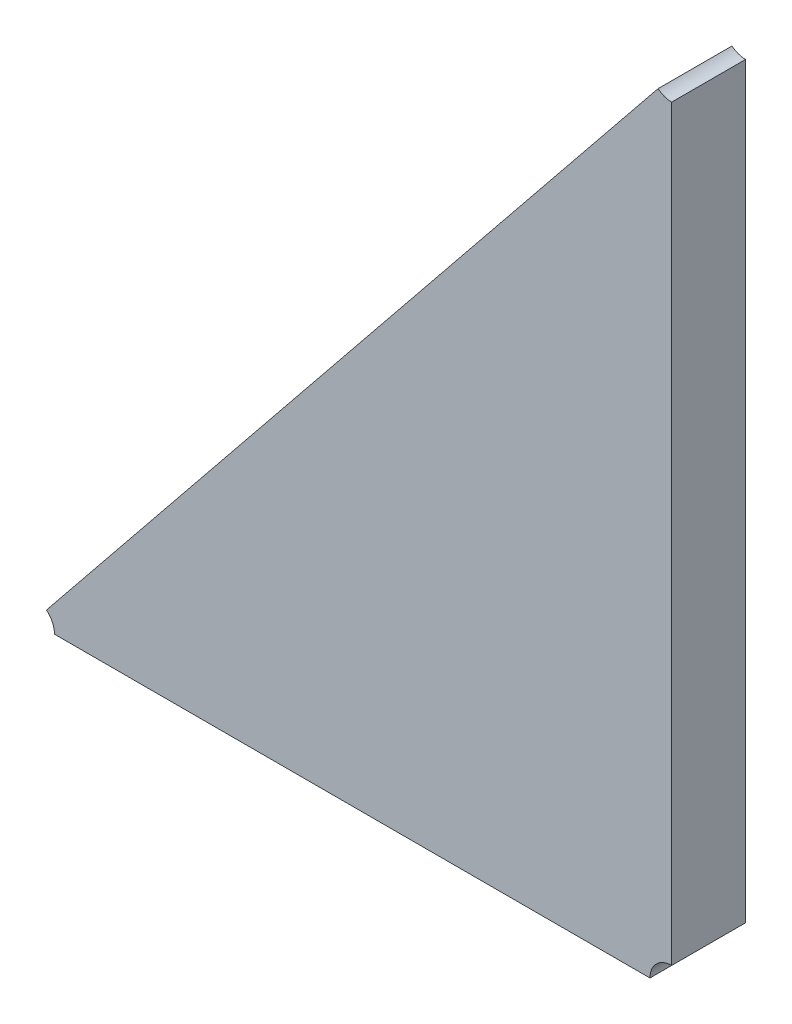
ISO-10303-21;
HEADER;
FILE_DESCRIPTION(('STEP AP214'),'2;1');
FILE_NAME('part.step','',(''),(''),'','','');
FILE_SCHEMA(('AUTOMOTIVE_DESIGN { 1 0 10303 214 1 1 1 1 }'));
ENDSEC;
DATA;
#1=APPLICATION_CONTEXT('core data for automotive mechanical design processes');
#2=APPLICATION_PROTOCOL_DEFINITION('international standard','automotive_design',2000,#1);
#3=PRODUCT_CONTEXT('',#1,'mechanical');
#4=PRODUCT('Part','Part','',(#3));
#5=PRODUCT_RELATED_PRODUCT_CATEGORY('part','',(#4));
#6=PRODUCT_DEFINITION_FORMATION('','',#4);
#7=PRODUCT_DEFINITION_CONTEXT('part definition',#1,'design');
#8=PRODUCT_DEFINITION('design','',#6,#7);
#9=PRODUCT_DEFINITION_SHAPE('','',#8);
#10=(LENGTH_UNIT() NAMED_UNIT(*) SI_UNIT(.MILLI.,.METRE.));
#11=(NAMED_UNIT(*) PLANE_ANGLE_UNIT() SI_UNIT($,.RADIAN.));
#12=(NAMED_UNIT(*) SI_UNIT($,.STERADIAN.) SOLID_ANGLE_UNIT());
#13=UNCERTAINTY_MEASURE_WITH_UNIT(LENGTH_MEASURE(1.E-05),#10,'distance_accuracy_value','');
#14=(GEOMETRIC_REPRESENTATION_CONTEXT(3) GLOBAL_UNCERTAINTY_ASSIGNED_CONTEXT((#13)) GLOBAL_UNIT_ASSIGNED_CONTEXT((#10,
#11,#12)) REPRESENTATION_CONTEXT('',''));
#15=CARTESIAN_POINT('',(0.,0.,0.));
#16=DIRECTION('',(0.,0.,1.));
#17=DIRECTION('',(1.,0.,0.));
#18=AXIS2_PLACEMENT_3D('',#15,#16,#17);
#19=CARTESIAN_POINT('',(-1.73054821123528,-1.35463051118407,0.0042));
#20=DIRECTION('',(0.,0.,1.));
#21=DIRECTION('',(1.,0.,0.));
#22=AXIS2_PLACEMENT_3D('',#19,#20,#21);
#23=PLANE('',#22);
#24=CARTESIAN_POINT('',(-1.76950550169011,-1.38144679395879,0.0042));
#25=DIRECTION('',(0.,0.,-1.));
#26=DIRECTION('',(0.628289208449183,0.777979865129104,0.));
#27=AXIS2_PLACEMENT_3D('',#24,#25,#26);
#28=CIRCLE('',#27,0.00199999999999998);
#29=CARTESIAN_POINT('',(-1.76824892327321,-1.37989083422853,0.0042));
#30=VERTEX_POINT('',#29);
#31=CARTESIAN_POINT('',(-1.76750550169011,-1.38144679395879,0.0042));
#32=VERTEX_POINT('',#31);
#33=EDGE_CURVE('E11',#30,#32,#28,.T.);
#34=ORIENTED_EDGE('',*,*,#33,.T.);
#35=DIRECTION('',(1.,0.,0.));
#36=VECTOR('',#35,1.);
#37=CARTESIAN_POINT('',(-1.76750550169011,-1.38144679395879,0.0042));
#38=LINE('',#37,#36);
#39=CARTESIAN_POINT('',(-1.71269826462096,-1.38144679395879,0.0042));
#40=VERTEX_POINT('',#39);
#41=EDGE_CURVE('E102',#32,#40,#38,.T.);
#42=ORIENTED_EDGE('',*,*,#41,.T.);
#43=CARTESIAN_POINT('',(-1.71069826462096,-1.38144679395879,0.0042));
#44=DIRECTION('',(0.,0.,-1.));
#45=DIRECTION('',(-1.,0.,0.));
#46=AXIS2_PLACEMENT_3D('',#43,#44,#45);
#47=CIRCLE('',#46,0.002);
#48=CARTESIAN_POINT('',(-1.71069826462096,-1.37944679395879,0.0042));
#49=VERTEX_POINT('',#48);
#50=EDGE_CURVE('E89',#40,#49,#47,.T.);
#51=ORIENTED_EDGE('',*,*,#50,.T.);
#52=DIRECTION('',(0.,1.,0.));
#53=VECTOR('',#52,1.);
#54=CARTESIAN_POINT('',(-1.71069826462096,-1.37944679395879,0.0042));
#55=LINE('',#54,#53);
#56=CARTESIAN_POINT('',(-1.71069826462096,-1.31062866219989,0.0042));
#57=VERTEX_POINT('',#56);
#58=EDGE_CURVE('E94',#49,#57,#55,.T.);
#59=ORIENTED_EDGE('',*,*,#58,.T.);
#60=CARTESIAN_POINT('',(-1.71069826462096,-1.30862866219989,0.0042));
#61=DIRECTION('',(0.,0.,-1.));
#62=DIRECTION('',(0.,-1.,0.));
#63=AXIS2_PLACEMENT_3D('',#60,#61,#62);
#64=CIRCLE('',#63,0.00199999999999999);
#65=CARTESIAN_POINT('',(-1.71195484303787,-1.31018462193015,0.0042));
#66=VERTEX_POINT('',#65);
#67=EDGE_CURVE('E116',#57,#66,#64,.T.);
#68=ORIENTED_EDGE('',*,*,#67,.T.);
#69=DIRECTION('',(-0.628289208450209,-0.777979865128276,0.));
#70=VECTOR('',#69,1.);
#71=CARTESIAN_POINT('',(-1.71195484303787,-1.31018462193015,0.0042));
#72=LINE('',#71,#70);
#73=EDGE_CURVE('E75',#66,#30,#72,.T.);
#74=ORIENTED_EDGE('',*,*,#73,.T.);
#75=EDGE_LOOP('',(#34,#42,#51,#59,#68,#74));
#76=FACE_BOUND('',#75,.T.);
#77=ADVANCED_FACE('F17',(#76),#23,.T.);
#78=CARTESIAN_POINT('',(-1.76950550169011,-1.38144679395879,-0.0018));
#79=DIRECTION('',(0.,0.,1.));
#80=DIRECTION('',(-1.,0.,0.));
#81=AXIS2_PLACEMENT_3D('',#78,#79,#80);
#82=CYLINDRICAL_SURFACE('',#81,0.00199999999999998);
#83=DIRECTION('',(0.,0.,1.));
#84=VECTOR('',#83,1.);
#85=CARTESIAN_POINT('',(-1.76824892327321,-1.37989083422853,-0.0026));
#86=LINE('',#85,#84);
#87=CARTESIAN_POINT('',(-1.76824892327321,-1.37989083422853,-0.0026));
#88=VERTEX_POINT('',#87);
#89=EDGE_CURVE('E24',#88,#30,#86,.T.);
#90=ORIENTED_EDGE('',*,*,#89,.F.);
#91=CARTESIAN_POINT('',(-1.76950550169011,-1.38144679395879,-0.0026));
#92=DIRECTION('',(0.,0.,1.));
#93=DIRECTION('',(1.,0.,0.));
#94=AXIS2_PLACEMENT_3D('',#91,#92,#93);
#95=CIRCLE('',#94,0.00199999999999998);
#96=CARTESIAN_POINT('',(-1.76750550169011,-1.38144679395879,-0.0026));
#97=VERTEX_POINT('',#96);
#98=EDGE_CURVE('E72',#97,#88,#95,.T.);
#99=ORIENTED_EDGE('',*,*,#98,.F.);
#100=DIRECTION('',(0.,0.,1.));
#101=VECTOR('',#100,1.);
#102=CARTESIAN_POINT('',(-1.76750550169011,-1.38144679395879,-0.0026));
#103=LINE('',#102,#101);
#104=EDGE_CURVE('E90',#97,#32,#103,.T.);
#105=ORIENTED_EDGE('',*,*,#104,.T.);
#106=ORIENTED_EDGE('',*,*,#33,.F.);
#107=EDGE_LOOP('',(#90,#99,#105,#106));
#108=FACE_BOUND('',#107,.T.);
#109=ADVANCED_FACE('F138',(#108),#82,.F.);
#110=CARTESIAN_POINT('',(-1.71069826462096,-1.38144679395879,-0.0018));
#111=DIRECTION('',(0.,0.,1.));
#112=DIRECTION('',(-1.,0.,0.));
#113=AXIS2_PLACEMENT_3D('',#110,#111,#112);
#114=CYLINDRICAL_SURFACE('',#113,0.002);
#115=DIRECTION('',(0.,0.,-1.));
#116=VECTOR('',#115,1.);
#117=CARTESIAN_POINT('',(-1.71069826462096,-1.37944679395879,0.0042));
#118=LINE('',#117,#116);
#119=CARTESIAN_POINT('',(-1.71069826462096,-1.37944679395879,-0.0026));
#120=VERTEX_POINT('',#119);
#121=EDGE_CURVE('E99',#49,#120,#118,.T.);
#122=ORIENTED_EDGE('',*,*,#121,.F.);
#123=ORIENTED_EDGE('',*,*,#50,.F.);
#124=DIRECTION('',(0.,0.,1.));
#125=VECTOR('',#124,1.);
#126=CARTESIAN_POINT('',(-1.71269826462096,-1.38144679395879,-0.0026));
#127=LINE('',#126,#125);
#128=CARTESIAN_POINT('',(-1.71269826462096,-1.38144679395879,-0.0026));
#129=VERTEX_POINT('',#128);
#130=EDGE_CURVE('E111',#129,#40,#127,.T.);
#131=ORIENTED_EDGE('',*,*,#130,.F.);
#132=CARTESIAN_POINT('',(-1.71069826462096,-1.38144679395879,-0.0026));
#133=DIRECTION('',(0.,0.,1.));
#134=DIRECTION('',(0.,1.,0.));
#135=AXIS2_PLACEMENT_3D('',#132,#133,#134);
#136=CIRCLE('',#135,0.002);
#137=EDGE_CURVE('E123',#120,#129,#136,.T.);
#138=ORIENTED_EDGE('',*,*,#137,.F.);
#139=EDGE_LOOP('',(#122,#123,#131,#138));
#140=FACE_BOUND('',#139,.T.);
#141=ADVANCED_FACE('F110',(#140),#114,.F.);
#142=CARTESIAN_POINT('',(-1.71069826462096,-1.30862866219989,-0.0018));
#143=DIRECTION('',(0.,0.,1.));
#144=DIRECTION('',(-1.,0.,0.));
#145=AXIS2_PLACEMENT_3D('',#142,#143,#144);
#146=CYLINDRICAL_SURFACE('',#145,0.00199999999999999);
#147=DIRECTION('',(0.,0.,-1.));
#148=VECTOR('',#147,1.);
#149=CARTESIAN_POINT('',(-1.71195484303787,-1.31018462193015,0.0042));
#150=LINE('',#149,#148);
#151=CARTESIAN_POINT('',(-1.71195484303787,-1.31018462193015,-0.0026));
#152=VERTEX_POINT('',#151);
#153=EDGE_CURVE('E80',#66,#152,#150,.T.);
#154=ORIENTED_EDGE('',*,*,#153,.F.);
#155=ORIENTED_EDGE('',*,*,#67,.F.);
#156=DIRECTION('',(0.,0.,1.));
#157=VECTOR('',#156,1.);
#158=CARTESIAN_POINT('',(-1.71069826462096,-1.31062866219989,-0.0026));
#159=LINE('',#158,#157);
#160=CARTESIAN_POINT('',(-1.71069826462096,-1.31062866219989,-0.0026));
#161=VERTEX_POINT('',#160);
#162=EDGE_CURVE('E83',#161,#57,#159,.T.);
#163=ORIENTED_EDGE('',*,*,#162,.F.);
#164=CARTESIAN_POINT('',(-1.71069826462096,-1.30862866219989,-0.0026));
#165=DIRECTION('',(0.,0.,1.));
#166=DIRECTION('',(-0.628289208452259,-0.77797986512662,0.));
#167=AXIS2_PLACEMENT_3D('',#164,#165,#166);
#168=CIRCLE('',#167,0.00199999999999999);
#169=EDGE_CURVE('E70',#152,#161,#168,.T.);
#170=ORIENTED_EDGE('',*,*,#169,.F.);
#171=EDGE_LOOP('',(#154,#155,#163,#170));
#172=FACE_BOUND('',#171,.T.);
#173=ADVANCED_FACE('F78',(#172),#146,.F.);
#174=CARTESIAN_POINT('',(-1.71069826462096,-1.38144679395879,-0.0026));
#175=DIRECTION('',(0.,1.,0.));
#176=DIRECTION('',(-1.,0.,0.));
#177=AXIS2_PLACEMENT_3D('',#174,#175,#176);
#178=PLANE('',#177);
#179=ORIENTED_EDGE('',*,*,#104,.F.);
#180=DIRECTION('',(-1.,0.,0.));
#181=VECTOR('',#180,1.);
#182=CARTESIAN_POINT('',(-1.71269826462096,-1.38144679395879,-0.0026));
#183=LINE('',#182,#181);
#184=EDGE_CURVE('E114',#129,#97,#183,.T.);
#185=ORIENTED_EDGE('',*,*,#184,.F.);
#186=ORIENTED_EDGE('',*,*,#130,.T.);
#187=ORIENTED_EDGE('',*,*,#41,.F.);
#188=EDGE_LOOP('',(#179,#185,#186,#187));
#189=FACE_BOUND('',#188,.T.);
#190=ADVANCED_FACE('F113',(#189),#178,.F.);
#191=CARTESIAN_POINT('',(-1.73059528913703,-1.35454432209785,-0.0026));
#192=DIRECTION('',(0.,0.,-1.));
#193=DIRECTION('',(-1.,0.,0.));
#194=AXIS2_PLACEMENT_3D('',#191,#192,#193);
#195=PLANE('',#194);
#196=ORIENTED_EDGE('',*,*,#98,.T.);
#197=DIRECTION('',(0.628289208450207,0.777979865128277,0.));
#198=VECTOR('',#197,1.);
#199=CARTESIAN_POINT('',(-1.76824892327321,-1.37989083422853,-0.0026));
#200=LINE('',#199,#198);
#201=EDGE_CURVE('E66',#88,#152,#200,.T.);
#202=ORIENTED_EDGE('',*,*,#201,.T.);
#203=ORIENTED_EDGE('',*,*,#169,.T.);
#204=DIRECTION('',(0.,-1.,0.));
#205=VECTOR('',#204,1.);
#206=CARTESIAN_POINT('',(-1.71069826462096,-1.31062866219989,-0.0026));
#207=LINE('',#206,#205);
#208=EDGE_CURVE('E85',#161,#120,#207,.T.);
#209=ORIENTED_EDGE('',*,*,#208,.T.);
#210=ORIENTED_EDGE('',*,*,#137,.T.);
#211=ORIENTED_EDGE('',*,*,#184,.T.);
#212=EDGE_LOOP('',(#196,#202,#203,#209,#210,#211));
#213=FACE_BOUND('',#212,.T.);
#214=ADVANCED_FACE('F68',(#213),#195,.T.);
#215=CARTESIAN_POINT('',(-1.71069826462096,-1.30862866219989,-0.0026));
#216=DIRECTION('',(-1.,0.,0.));
#217=DIRECTION('',(0.,-1.,0.));
#218=AXIS2_PLACEMENT_3D('',#215,#216,#217);
#219=PLANE('',#218);
#220=ORIENTED_EDGE('',*,*,#121,.T.);
#221=ORIENTED_EDGE('',*,*,#208,.F.);
#222=ORIENTED_EDGE('',*,*,#162,.T.);
#223=ORIENTED_EDGE('',*,*,#58,.F.);
#224=EDGE_LOOP('',(#220,#221,#222,#223));
#225=FACE_BOUND('',#224,.T.);
#226=ADVANCED_FACE('F122',(#225),#219,.F.);
#227=CARTESIAN_POINT('',(-1.76950550169011,-1.38144679395879,-0.0026));
#228=DIRECTION('',(0.777979865128275,-0.628289208450209,0.));
#229=DIRECTION('',(0.628289208450209,0.777979865128275,0.));
#230=AXIS2_PLACEMENT_3D('',#227,#228,#229);
#231=PLANE('',#230);
#232=ORIENTED_EDGE('',*,*,#89,.T.);
#233=ORIENTED_EDGE('',*,*,#73,.F.);
#234=ORIENTED_EDGE('',*,*,#153,.T.);
#235=ORIENTED_EDGE('',*,*,#201,.F.);
#236=EDGE_LOOP('',(#232,#233,#234,#235));
#237=FACE_BOUND('',#236,.T.);
#238=ADVANCED_FACE('F88',(#237),#231,.F.);
#239=CLOSED_SHELL('',(#77,#109,#141,#173,#190,#214,#226,#238));
#240=MANIFOLD_SOLID_BREP('B1',#239);
#241=ADVANCED_BREP_SHAPE_REPRESENTATION('',(#18,#240),#14);
#242=SHAPE_DEFINITION_REPRESENTATION(#9,#241);
ENDSEC;
END-ISO-10303-21;
